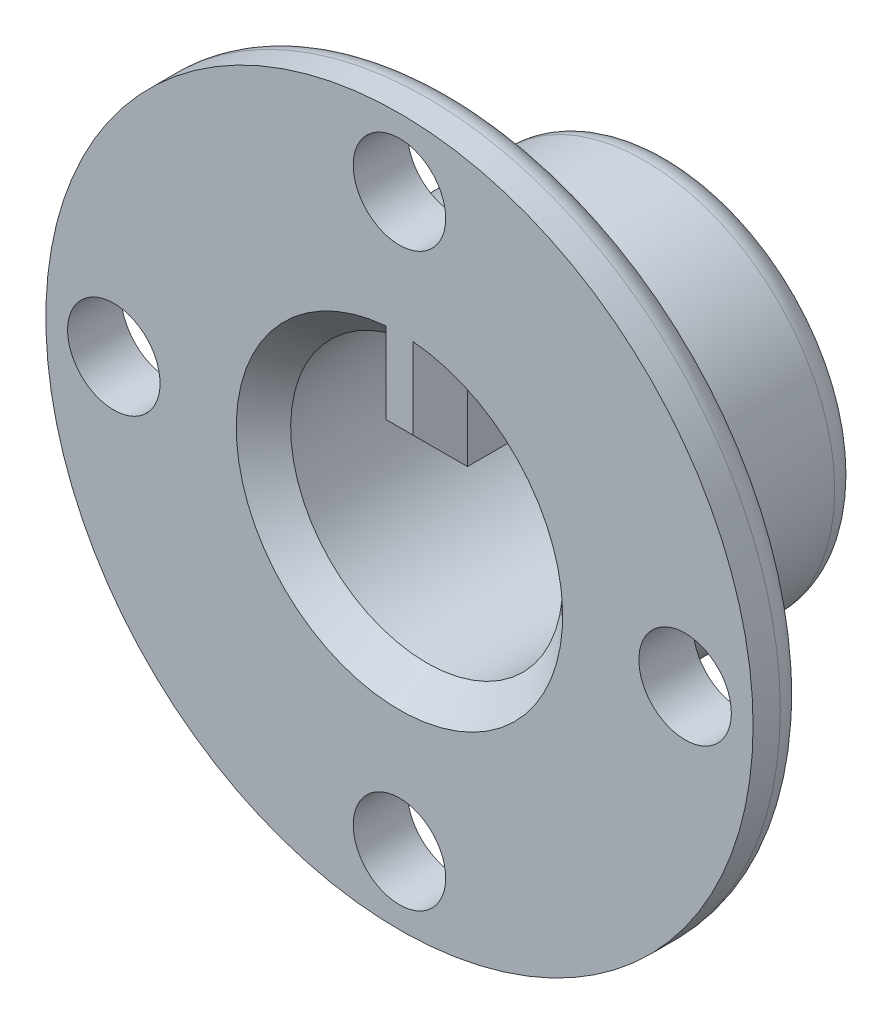
ISO-10303-21;
HEADER;
FILE_DESCRIPTION(('STEP AP214'),'2;1');
FILE_NAME('part.step','',(''),(''),'','','');
FILE_SCHEMA(('AUTOMOTIVE_DESIGN { 1 0 10303 214 1 1 1 1 }'));
ENDSEC;
DATA;
#1=APPLICATION_CONTEXT('core data for automotive mechanical design processes');
#2=APPLICATION_PROTOCOL_DEFINITION('international standard','automotive_design',2000,#1);
#3=PRODUCT_CONTEXT('',#1,'mechanical');
#4=PRODUCT('Part','Part','',(#3));
#5=PRODUCT_RELATED_PRODUCT_CATEGORY('part','',(#4));
#6=PRODUCT_DEFINITION_FORMATION('','',#4);
#7=PRODUCT_DEFINITION_CONTEXT('part definition',#1,'design');
#8=PRODUCT_DEFINITION('design','',#6,#7);
#9=PRODUCT_DEFINITION_SHAPE('','',#8);
#10=(LENGTH_UNIT() NAMED_UNIT(*) SI_UNIT(.MILLI.,.METRE.));
#11=(NAMED_UNIT(*) PLANE_ANGLE_UNIT() SI_UNIT($,.RADIAN.));
#12=(NAMED_UNIT(*) SI_UNIT($,.STERADIAN.) SOLID_ANGLE_UNIT());
#13=UNCERTAINTY_MEASURE_WITH_UNIT(LENGTH_MEASURE(1.E-05),#10,'distance_accuracy_value','');
#14=(GEOMETRIC_REPRESENTATION_CONTEXT(3) GLOBAL_UNCERTAINTY_ASSIGNED_CONTEXT((#13)) GLOBAL_UNIT_ASSIGNED_CONTEXT((#10,
#11,#12)) REPRESENTATION_CONTEXT('',''));
#15=CARTESIAN_POINT('',(0.,0.,0.));
#16=DIRECTION('',(0.,0.,1.));
#17=DIRECTION('',(1.,0.,0.));
#18=AXIS2_PLACEMENT_3D('',#15,#16,#17);
#19=CARTESIAN_POINT('',(0.,0.,-10.));
#20=DIRECTION('',(0.,0.,1.));
#21=DIRECTION('',(1.,0.,0.));
#22=AXIS2_PLACEMENT_3D('',#19,#20,#21);
#23=CYLINDRICAL_SURFACE('',#22,7.);
#24=CARTESIAN_POINT('',(0.,0.,-3.));
#25=DIRECTION('',(0.,0.,1.));
#26=DIRECTION('',(1.,0.,0.));
#27=AXIS2_PLACEMENT_3D('',#24,#25,#26);
#28=CIRCLE('',#27,7.);
#29=CARTESIAN_POINT('',(7.,0.,-3.));
#30=VERTEX_POINT('',#29);
#31=EDGE_CURVE('E574',#30,#30,#28,.F.);
#32=ORIENTED_EDGE('',*,*,#31,.T.);
#33=EDGE_LOOP('',(#32));
#34=FACE_BOUND('',#33,.T.);
#35=CARTESIAN_POINT('',(0.,0.,-9.));
#36=DIRECTION('',(0.,0.,1.));
#37=DIRECTION('',(1.,0.,0.));
#38=AXIS2_PLACEMENT_3D('',#35,#36,#37);
#39=CIRCLE('',#38,7.);
#40=CARTESIAN_POINT('',(7.,0.,-9.));
#41=VERTEX_POINT('',#40);
#42=EDGE_CURVE('E571',#41,#41,#39,.T.);
#43=ORIENTED_EDGE('',*,*,#42,.T.);
#44=EDGE_LOOP('',(#43));
#45=FACE_BOUND('',#44,.T.);
#46=ADVANCED_FACE('F36',(#34,#45),#23,.T.);
#47=CARTESIAN_POINT('',(0.,0.,-10.));
#48=DIRECTION('',(0.,0.,1.));
#49=DIRECTION('',(1.,0.,0.));
#50=AXIS2_PLACEMENT_3D('',#47,#48,#49);
#51=CYLINDRICAL_SURFACE('',#50,5.);
#52=DIRECTION('',(0.,0.,1.));
#53=VECTOR('',#52,1.);
#54=CARTESIAN_POINT('',(-1.5,4.76969600708473,-10.));
#55=LINE('',#54,#53);
#56=CARTESIAN_POINT('',(-1.5,4.76969600708473,-9.));
#57=VERTEX_POINT('',#56);
#58=CARTESIAN_POINT('',(-1.5,4.76969600708473,-1.));
#59=VERTEX_POINT('',#58);
#60=EDGE_CURVE('E136',#57,#59,#55,.T.);
#61=ORIENTED_EDGE('',*,*,#60,.T.);
#62=CARTESIAN_POINT('',(0.,0.,-1.));
#63=DIRECTION('',(0.,0.,1.));
#64=DIRECTION('',(1.,0.,0.));
#65=AXIS2_PLACEMENT_3D('',#62,#63,#64);
#66=CIRCLE('',#65,5.);
#67=CARTESIAN_POINT('',(1.5,4.76969600708473,-1.));
#68=VERTEX_POINT('',#67);
#69=EDGE_CURVE('E11',#59,#68,#66,.T.);
#70=ORIENTED_EDGE('',*,*,#69,.T.);
#71=DIRECTION('',(0.,0.,1.));
#72=VECTOR('',#71,1.);
#73=CARTESIAN_POINT('',(1.5,4.76969600708473,-10.));
#74=LINE('',#73,#72);
#75=CARTESIAN_POINT('',(1.5,4.76969600708473,-9.));
#76=VERTEX_POINT('',#75);
#77=EDGE_CURVE('E139',#76,#68,#74,.T.);
#78=ORIENTED_EDGE('',*,*,#77,.F.);
#79=CARTESIAN_POINT('',(0.,0.,-9.));
#80=DIRECTION('',(0.,0.,1.));
#81=DIRECTION('',(1.,0.,0.));
#82=AXIS2_PLACEMENT_3D('',#79,#80,#81);
#83=CIRCLE('',#82,5.);
#84=EDGE_CURVE('E134',#76,#57,#83,.F.);
#85=ORIENTED_EDGE('',*,*,#84,.T.);
#86=EDGE_LOOP('',(#61,#70,#78,#85));
#87=FACE_BOUND('',#86,.T.);
#88=ADVANCED_FACE('F135',(#87),#51,.F.);
#89=CARTESIAN_POINT('',(1.5,0.,-10.));
#90=DIRECTION('',(-1.,0.,0.));
#91=DIRECTION('',(0.,-1.,0.));
#92=AXIS2_PLACEMENT_3D('',#89,#90,#91);
#93=PLANE('',#92);
#94=ORIENTED_EDGE('',*,*,#77,.T.);
#95=DIRECTION('',(0.,-1.,0.));
#96=VECTOR('',#95,1.);
#97=CARTESIAN_POINT('',(1.5,2.,-1.));
#98=LINE('',#97,#96);
#99=CARTESIAN_POINT('',(1.5,2.,-1.));
#100=VERTEX_POINT('',#99);
#101=EDGE_CURVE('E502',#68,#100,#98,.T.);
#102=ORIENTED_EDGE('',*,*,#101,.T.);
#103=DIRECTION('',(0.,0.,1.));
#104=VECTOR('',#103,1.);
#105=CARTESIAN_POINT('',(1.5,2.,-10.));
#106=LINE('',#105,#104);
#107=CARTESIAN_POINT('',(1.5,2.,-9.));
#108=VERTEX_POINT('',#107);
#109=EDGE_CURVE('E170',#108,#100,#106,.T.);
#110=ORIENTED_EDGE('',*,*,#109,.F.);
#111=DIRECTION('',(0.,1.,0.));
#112=VECTOR('',#111,1.);
#113=CARTESIAN_POINT('',(1.5,0.,-9.));
#114=LINE('',#113,#112);
#115=EDGE_CURVE('E145',#108,#76,#114,.T.);
#116=ORIENTED_EDGE('',*,*,#115,.T.);
#117=EDGE_LOOP('',(#94,#102,#110,#116));
#118=FACE_BOUND('',#117,.T.);
#119=ADVANCED_FACE('F290',(#118),#93,.F.);
#120=CARTESIAN_POINT('',(0.,2.,-10.));
#121=DIRECTION('',(0.,-1.,0.));
#122=DIRECTION('',(0.,0.,-1.));
#123=AXIS2_PLACEMENT_3D('',#120,#121,#122);
#124=PLANE('',#123);
#125=ORIENTED_EDGE('',*,*,#109,.T.);
#126=DIRECTION('',(-1.,0.,0.));
#127=VECTOR('',#126,1.);
#128=CARTESIAN_POINT('',(0.,2.,-1.));
#129=LINE('',#128,#127);
#130=CARTESIAN_POINT('',(-1.5,2.,-1.));
#131=VERTEX_POINT('',#130);
#132=EDGE_CURVE('E66',#100,#131,#129,.T.);
#133=ORIENTED_EDGE('',*,*,#132,.T.);
#134=DIRECTION('',(0.,0.,1.));
#135=VECTOR('',#134,1.);
#136=CARTESIAN_POINT('',(-1.5,2.,-10.));
#137=LINE('',#136,#135);
#138=CARTESIAN_POINT('',(-1.5,2.,-9.));
#139=VERTEX_POINT('',#138);
#140=EDGE_CURVE('E151',#139,#131,#137,.T.);
#141=ORIENTED_EDGE('',*,*,#140,.F.);
#142=DIRECTION('',(1.,0.,0.));
#143=VECTOR('',#142,1.);
#144=CARTESIAN_POINT('',(1.5,2.,-9.));
#145=LINE('',#144,#143);
#146=EDGE_CURVE('E180',#139,#108,#145,.T.);
#147=ORIENTED_EDGE('',*,*,#146,.T.);
#148=EDGE_LOOP('',(#125,#133,#141,#147));
#149=FACE_BOUND('',#148,.T.);
#150=ADVANCED_FACE('F293',(#149),#124,.T.);
#151=CARTESIAN_POINT('',(-1.5,0.,-10.));
#152=DIRECTION('',(-1.,0.,0.));
#153=DIRECTION('',(0.,-1.,0.));
#154=AXIS2_PLACEMENT_3D('',#151,#152,#153);
#155=PLANE('',#154);
#156=ORIENTED_EDGE('',*,*,#140,.T.);
#157=DIRECTION('',(0.,1.,0.));
#158=VECTOR('',#157,1.);
#159=CARTESIAN_POINT('',(-1.5,0.,-1.));
#160=LINE('',#159,#158);
#161=EDGE_CURVE('E51',#131,#59,#160,.T.);
#162=ORIENTED_EDGE('',*,*,#161,.T.);
#163=ORIENTED_EDGE('',*,*,#60,.F.);
#164=DIRECTION('',(0.,-1.,0.));
#165=VECTOR('',#164,1.);
#166=CARTESIAN_POINT('',(-1.5,2.,-9.));
#167=LINE('',#166,#165);
#168=EDGE_CURVE('E150',#57,#139,#167,.T.);
#169=ORIENTED_EDGE('',*,*,#168,.T.);
#170=EDGE_LOOP('',(#156,#162,#163,#169));
#171=FACE_BOUND('',#170,.T.);
#172=ADVANCED_FACE('F148',(#171),#155,.T.);
#173=CARTESIAN_POINT('',(0.,0.,-10.));
#174=DIRECTION('',(0.,0.,1.));
#175=DIRECTION('',(1.,0.,0.));
#176=AXIS2_PLACEMENT_3D('',#173,#174,#175);
#177=PLANE('',#176);
#178=DIRECTION('',(0.,1.,0.));
#179=VECTOR('',#178,1.);
#180=CARTESIAN_POINT('',(-0.500000000000002,4.76969600708473,-10.));
#181=LINE('',#180,#179);
#182=CARTESIAN_POINT('',(-0.500000000000002,3.,-10.));
#183=VERTEX_POINT('',#182);
#184=CARTESIAN_POINT('',(-0.500000000000002,5.9791303715507,-10.));
#185=VERTEX_POINT('',#184);
#186=EDGE_CURVE('E178',#183,#185,#181,.T.);
#187=ORIENTED_EDGE('',*,*,#186,.T.);
#188=CARTESIAN_POINT('',(0.,0.,-10.));
#189=DIRECTION('',(0.,0.,1.));
#190=DIRECTION('',(1.,0.,0.));
#191=AXIS2_PLACEMENT_3D('',#188,#189,#190);
#192=CIRCLE('',#191,6.);
#193=CARTESIAN_POINT('',(0.500000000000001,5.9791303715507,-10.));
#194=VERTEX_POINT('',#193);
#195=EDGE_CURVE('E515',#185,#194,#192,.F.);
#196=ORIENTED_EDGE('',*,*,#195,.T.);
#197=DIRECTION('',(0.,-1.,0.));
#198=VECTOR('',#197,1.);
#199=CARTESIAN_POINT('',(0.500000000000002,0.,-10.));
#200=LINE('',#199,#198);
#201=CARTESIAN_POINT('',(0.500000000000002,3.,-10.));
#202=VERTEX_POINT('',#201);
#203=EDGE_CURVE('E168',#194,#202,#200,.T.);
#204=ORIENTED_EDGE('',*,*,#203,.T.);
#205=DIRECTION('',(-1.,0.,0.));
#206=VECTOR('',#205,1.);
#207=CARTESIAN_POINT('',(-1.5,3.,-10.));
#208=LINE('',#207,#206);
#209=EDGE_CURVE('E176',#202,#183,#208,.T.);
#210=ORIENTED_EDGE('',*,*,#209,.T.);
#211=EDGE_LOOP('',(#187,#196,#204,#210));
#212=FACE_BOUND('',#211,.T.);
#213=ADVANCED_FACE('F280',(#212),#177,.F.);
#214=CARTESIAN_POINT('',(0.,0.,0.));
#215=DIRECTION('',(0.,0.,1.));
#216=DIRECTION('',(1.,0.,0.));
#217=AXIS2_PLACEMENT_3D('',#214,#215,#216);
#218=PLANE('',#217);
#219=DIRECTION('',(1.,0.,0.));
#220=VECTOR('',#219,1.);
#221=CARTESIAN_POINT('',(0.,3.00000000000001,0.));
#222=LINE('',#221,#220);
#223=CARTESIAN_POINT('',(-0.499999999999995,3.00000000000001,0.));
#224=VERTEX_POINT('',#223);
#225=CARTESIAN_POINT('',(0.499999999999995,3.00000000000001,0.));
#226=VERTEX_POINT('',#225);
#227=EDGE_CURVE('E498',#224,#226,#222,.T.);
#228=ORIENTED_EDGE('',*,*,#227,.T.);
#229=DIRECTION('',(0.,1.,0.));
#230=VECTOR('',#229,1.);
#231=CARTESIAN_POINT('',(0.499999999999995,4.76969600708473,0.));
#232=LINE('',#231,#230);
#233=CARTESIAN_POINT('',(0.499999999999995,5.97913037155071,0.));
#234=VERTEX_POINT('',#233);
#235=EDGE_CURVE('E500',#226,#234,#232,.T.);
#236=ORIENTED_EDGE('',*,*,#235,.T.);
#237=CARTESIAN_POINT('',(0.,0.,0.));
#238=DIRECTION('',(0.,0.,1.));
#239=DIRECTION('',(1.,0.,0.));
#240=AXIS2_PLACEMENT_3D('',#237,#238,#239);
#241=CIRCLE('',#240,6.00000000000001);
#242=CARTESIAN_POINT('',(-0.499999999999995,5.97913037155071,0.));
#243=VERTEX_POINT('',#242);
#244=EDGE_CURVE('E494',#234,#243,#241,.F.);
#245=ORIENTED_EDGE('',*,*,#244,.T.);
#246=DIRECTION('',(0.,-1.,0.));
#247=VECTOR('',#246,1.);
#248=CARTESIAN_POINT('',(-0.499999999999995,0.,0.));
#249=LINE('',#248,#247);
#250=EDGE_CURVE('E497',#243,#224,#249,.T.);
#251=ORIENTED_EDGE('',*,*,#250,.T.);
#252=EDGE_LOOP('',(#228,#236,#245,#251));
#253=FACE_BOUND('',#252,.T.);
#254=CARTESIAN_POINT('',(0.,10.5,0.));
#255=DIRECTION('',(0.,0.,1.));
#256=DIRECTION('',(1.,0.,0.));
#257=AXIS2_PLACEMENT_3D('',#254,#255,#256);
#258=CIRCLE('',#257,1.69999999999999);
#259=CARTESIAN_POINT('',(1.69999999999999,10.5,0.));
#260=VERTEX_POINT('',#259);
#261=EDGE_CURVE('E206',#260,#260,#258,.T.);
#262=ORIENTED_EDGE('',*,*,#261,.F.);
#263=EDGE_LOOP('',(#262));
#264=FACE_BOUND('',#263,.T.);
#265=CARTESIAN_POINT('',(10.5000000000003,2.54785051264339E-13,0.));
#266=DIRECTION('',(0.,0.,1.));
#267=DIRECTION('',(1.,0.,0.));
#268=AXIS2_PLACEMENT_3D('',#265,#266,#267);
#269=CIRCLE('',#268,1.69999999999999);
#270=CARTESIAN_POINT('',(12.2000000000002,2.54785051264339E-13,0.));
#271=VERTEX_POINT('',#270);
#272=EDGE_CURVE('E533',#271,#271,#269,.T.);
#273=ORIENTED_EDGE('',*,*,#272,.F.);
#274=EDGE_LOOP('',(#273));
#275=FACE_BOUND('',#274,.T.);
#276=CARTESIAN_POINT('',(5.09570102528679E-13,-10.5,0.));
#277=DIRECTION('',(0.,0.,1.));
#278=DIRECTION('',(1.,0.,0.));
#279=AXIS2_PLACEMENT_3D('',#276,#277,#278);
#280=CIRCLE('',#279,1.69999999999999);
#281=CARTESIAN_POINT('',(1.7000000000005,-10.5,0.));
#282=VERTEX_POINT('',#281);
#283=EDGE_CURVE('E527',#282,#282,#280,.T.);
#284=ORIENTED_EDGE('',*,*,#283,.F.);
#285=EDGE_LOOP('',(#284));
#286=FACE_BOUND('',#285,.T.);
#287=CARTESIAN_POINT('',(-10.4999999999997,-2.53499172125235E-13,0.));
#288=DIRECTION('',(0.,0.,1.));
#289=DIRECTION('',(1.,0.,0.));
#290=AXIS2_PLACEMENT_3D('',#287,#288,#289);
#291=CIRCLE('',#290,1.69999999999999);
#292=CARTESIAN_POINT('',(-8.79999999999976,-2.53499172125235E-13,0.));
#293=VERTEX_POINT('',#292);
#294=EDGE_CURVE('E521',#293,#293,#291,.T.);
#295=ORIENTED_EDGE('',*,*,#294,.F.);
#296=EDGE_LOOP('',(#295));
#297=FACE_BOUND('',#296,.T.);
#298=CARTESIAN_POINT('',(0.,0.,0.));
#299=DIRECTION('',(0.,0.,1.));
#300=DIRECTION('',(1.,0.,0.));
#301=AXIS2_PLACEMENT_3D('',#298,#299,#300);
#302=CIRCLE('',#301,13.);
#303=CARTESIAN_POINT('',(13.,0.,0.));
#304=VERTEX_POINT('',#303);
#305=EDGE_CURVE('E152',#304,#304,#302,.T.);
#306=ORIENTED_EDGE('',*,*,#305,.T.);
#307=EDGE_LOOP('',(#306));
#308=FACE_BOUND('',#307,.T.);
#309=ADVANCED_FACE('F278',(#253,#264,#275,#286,#297,#308),#218,.T.);
#310=CARTESIAN_POINT('',(0.,0.,-2.));
#311=DIRECTION('',(0.,0.,1.));
#312=DIRECTION('',(1.,0.,0.));
#313=AXIS2_PLACEMENT_3D('',#310,#311,#312);
#314=CYLINDRICAL_SURFACE('',#313,13.);
#315=CARTESIAN_POINT('',(0.,0.,-1.));
#316=DIRECTION('',(0.,0.,1.));
#317=DIRECTION('',(1.,0.,0.));
#318=AXIS2_PLACEMENT_3D('',#315,#316,#317);
#319=CIRCLE('',#318,13.);
#320=CARTESIAN_POINT('',(13.,0.,-1.));
#321=VERTEX_POINT('',#320);
#322=EDGE_CURVE('E576',#321,#321,#319,.T.);
#323=ORIENTED_EDGE('',*,*,#322,.T.);
#324=EDGE_LOOP('',(#323));
#325=FACE_BOUND('',#324,.T.);
#326=ORIENTED_EDGE('',*,*,#305,.F.);
#327=EDGE_LOOP('',(#326));
#328=FACE_BOUND('',#327,.T.);
#329=ADVANCED_FACE('F274',(#325,#328),#314,.T.);
#330=CARTESIAN_POINT('',(0.,0.,-2.));
#331=DIRECTION('',(0.,0.,1.));
#332=DIRECTION('',(1.,0.,0.));
#333=AXIS2_PLACEMENT_3D('',#330,#331,#332);
#334=PLANE('',#333);
#335=CARTESIAN_POINT('',(0.,0.,-2.));
#336=DIRECTION('',(0.,0.,1.));
#337=DIRECTION('',(1.,0.,0.));
#338=AXIS2_PLACEMENT_3D('',#335,#336,#337);
#339=CIRCLE('',#338,8.);
#340=CARTESIAN_POINT('',(8.,0.,-2.));
#341=VERTEX_POINT('',#340);
#342=EDGE_CURVE('E566',#341,#341,#339,.T.);
#343=ORIENTED_EDGE('',*,*,#342,.T.);
#344=EDGE_LOOP('',(#343));
#345=FACE_BOUND('',#344,.T.);
#346=CARTESIAN_POINT('',(5.09570102528679E-13,-10.5,-2.));
#347=DIRECTION('',(0.,0.,1.));
#348=DIRECTION('',(1.,0.,0.));
#349=AXIS2_PLACEMENT_3D('',#346,#347,#348);
#350=CIRCLE('',#349,1.69999999999999);
#351=CARTESIAN_POINT('',(0.854692794659928,-11.9695238095238,-2.));
#352=VERTEX_POINT('',#351);
#353=CARTESIAN_POINT('',(-0.854692794658766,-11.9695238095239,-2.));
#354=VERTEX_POINT('',#353);
#355=EDGE_CURVE('E524',#352,#354,#350,.T.);
#356=ORIENTED_EDGE('',*,*,#355,.T.);
#357=CARTESIAN_POINT('',(0.,0.,-2.));
#358=DIRECTION('',(0.,0.,1.));
#359=DIRECTION('',(1.,0.,0.));
#360=AXIS2_PLACEMENT_3D('',#357,#358,#359);
#361=CIRCLE('',#360,12.);
#362=CARTESIAN_POINT('',(-11.9695238095238,-0.85469279465914,-2.));
#363=VERTEX_POINT('',#362);
#364=EDGE_CURVE('E560',#354,#363,#361,.F.);
#365=ORIENTED_EDGE('',*,*,#364,.T.);
#366=CARTESIAN_POINT('',(-10.4999999999997,-2.53499172125235E-13,-2.));
#367=DIRECTION('',(0.,0.,1.));
#368=DIRECTION('',(1.,0.,0.));
#369=AXIS2_PLACEMENT_3D('',#366,#367,#368);
#370=CIRCLE('',#369,1.69999999999999);
#371=CARTESIAN_POINT('',(-11.9695238095239,0.854692794658562,-2.));
#372=VERTEX_POINT('',#371);
#373=EDGE_CURVE('E173',#363,#372,#370,.T.);
#374=ORIENTED_EDGE('',*,*,#373,.T.);
#375=CARTESIAN_POINT('',(0.,0.,-2.));
#376=DIRECTION('',(0.,0.,1.));
#377=DIRECTION('',(1.,0.,0.));
#378=AXIS2_PLACEMENT_3D('',#375,#376,#377);
#379=CIRCLE('',#378,12.);
#380=CARTESIAN_POINT('',(-0.854692794659346,11.9695238095238,-2.));
#381=VERTEX_POINT('',#380);
#382=EDGE_CURVE('E557',#372,#381,#379,.F.);
#383=ORIENTED_EDGE('',*,*,#382,.T.);
#384=CARTESIAN_POINT('',(0.,10.5,-2.));
#385=DIRECTION('',(0.,0.,1.));
#386=DIRECTION('',(1.,0.,0.));
#387=AXIS2_PLACEMENT_3D('',#384,#385,#386);
#388=CIRCLE('',#387,1.69999999999999);
#389=CARTESIAN_POINT('',(0.854692794659347,11.9695238095238,-2.));
#390=VERTEX_POINT('',#389);
#391=EDGE_CURVE('E536',#381,#390,#388,.T.);
#392=ORIENTED_EDGE('',*,*,#391,.T.);
#393=CARTESIAN_POINT('',(0.,0.,-2.));
#394=DIRECTION('',(0.,0.,1.));
#395=DIRECTION('',(1.,0.,0.));
#396=AXIS2_PLACEMENT_3D('',#393,#394,#395);
#397=CIRCLE('',#396,12.);
#398=CARTESIAN_POINT('',(11.9695238095238,0.854692794660137,-2.));
#399=VERTEX_POINT('',#398);
#400=EDGE_CURVE('E564',#390,#399,#397,.F.);
#401=ORIENTED_EDGE('',*,*,#400,.T.);
#402=CARTESIAN_POINT('',(10.5000000000003,2.54785051264339E-13,-2.));
#403=DIRECTION('',(0.,0.,1.));
#404=DIRECTION('',(1.,0.,0.));
#405=AXIS2_PLACEMENT_3D('',#402,#403,#404);
#406=CIRCLE('',#405,1.69999999999999);
#407=CARTESIAN_POINT('',(11.9695238095238,-0.854692794659556,-2.));
#408=VERTEX_POINT('',#407);
#409=EDGE_CURVE('E530',#399,#408,#406,.T.);
#410=ORIENTED_EDGE('',*,*,#409,.T.);
#411=CARTESIAN_POINT('',(0.,0.,-2.));
#412=DIRECTION('',(0.,0.,1.));
#413=DIRECTION('',(1.,0.,0.));
#414=AXIS2_PLACEMENT_3D('',#411,#412,#413);
#415=CIRCLE('',#414,12.);
#416=EDGE_CURVE('E144',#408,#352,#415,.F.);
#417=ORIENTED_EDGE('',*,*,#416,.T.);
#418=EDGE_LOOP('',(#356,#365,#374,#383,#392,#401,#410,#417));
#419=FACE_BOUND('',#418,.T.);
#420=ADVANCED_FACE('F270',(#345,#419),#334,.F.);
#421=CARTESIAN_POINT('',(-10.4999999999997,-2.53499172125235E-13,0.));
#422=DIRECTION('',(0.,0.,1.));
#423=DIRECTION('',(1.,0.,0.));
#424=AXIS2_PLACEMENT_3D('',#421,#422,#423);
#425=CYLINDRICAL_SURFACE('',#424,1.69999999999999);
#426=ORIENTED_EDGE('',*,*,#294,.T.);
#427=EDGE_LOOP('',(#426));
#428=FACE_BOUND('',#427,.T.);
#429=ORIENTED_EDGE('',*,*,#373,.F.);
#430=CARTESIAN_POINT('',(-11.9695238095238,-0.85469279465914,-2.));
#431=CARTESIAN_POINT('',(-11.9907989521545,-0.818118476335102,-1.99999167514858));
#432=CARTESIAN_POINT('',(-12.0106996864025,-0.780754621558648,-1.9994802049691));
#433=CARTESIAN_POINT('',(-12.0476524940484,-0.704668530802149,-1.99780534300635));
#434=CARTESIAN_POINT('',(-12.0647052847368,-0.665946639842547,-1.99664211569875));
#435=CARTESIAN_POINT('',(-12.0958791685183,-0.587331427447288,-1.9940172436299));
#436=CARTESIAN_POINT('',(-12.1099991344167,-0.547437662315396,-1.99255548455819));
#437=CARTESIAN_POINT('',(-12.135226985244,-0.466715892591268,-1.98961919478434));
#438=CARTESIAN_POINT('',(-12.146334516253,-0.42588777883633,-1.98814466260252));
#439=CARTESIAN_POINT('',(-12.1773451283286,-0.292364612404048,-1.98376291937527));
#440=CARTESIAN_POINT('',(-12.1910768440933,-0.198128986292941,-1.98134629765861));
#441=CARTESIAN_POINT('',(-12.2026270400247,-0.00868965115883323,-1.97934392315493));
#442=CARTESIAN_POINT('',(-12.2004438006943,0.0865141613600884,-1.97975847625579));
#443=CARTESIAN_POINT('',(-12.1802946890029,0.274882177317589,-1.98314537919746));
#444=CARTESIAN_POINT('',(-12.1623761376599,0.368051638422774,-1.98611005945902));
#445=CARTESIAN_POINT('',(-12.1113279339275,0.550023365008609,-1.99259769710575));
#446=CARTESIAN_POINT('',(-12.0782216042406,0.638832096276497,-1.99611979309806));
#447=CARTESIAN_POINT('',(-12.0275547219862,0.746448062596245,-1.99875571250405));
#448=CARTESIAN_POINT('',(-12.0165983584882,0.768463230294706,-1.99920346087392));
#449=CARTESIAN_POINT('',(-11.9937561746306,0.811968859827391,-1.99982558668344));
#450=CARTESIAN_POINT('',(-11.9818717320704,0.833460039577419,-2.00000036156515));
#451=CARTESIAN_POINT('',(-11.9695238095239,0.854692794658562,-2.));
#452=B_SPLINE_CURVE_WITH_KNOTS('',3,(#430,#431,#432,#433,#434,#435,#436,#437,#438,#439,#440,
#441,#442,#443,#444,#445,#446,#447,#448,#449,#450,#451),.UNSPECIFIED.,.F.,.F.,(4,2,2,2,2,2,2,2,
2,2,4),(0.,0.126891225193106,0.253750442874268,0.380658327461467,0.507581115539993,
0.791880766971805,1.07621113540444,1.3596893502973,1.64273369919196,1.7165027060509,
1.79016420676154),.UNSPECIFIED.);
#453=EDGE_CURVE('E227',#363,#372,#452,.T.);
#454=ORIENTED_EDGE('',*,*,#453,.T.);
#455=EDGE_LOOP('',(#429,#454));
#456=FACE_BOUND('',#455,.T.);
#457=ADVANCED_FACE('F265',(#428,#456),#425,.F.);
#458=CARTESIAN_POINT('',(5.09570102528679E-13,-10.5,0.));
#459=DIRECTION('',(0.,0.,1.));
#460=DIRECTION('',(1.,0.,0.));
#461=AXIS2_PLACEMENT_3D('',#458,#459,#460);
#462=CYLINDRICAL_SURFACE('',#461,1.69999999999999);
#463=ORIENTED_EDGE('',*,*,#283,.T.);
#464=EDGE_LOOP('',(#463));
#465=FACE_BOUND('',#464,.T.);
#466=ORIENTED_EDGE('',*,*,#355,.F.);
#467=CARTESIAN_POINT('',(0.854692794659928,-11.9695238095238,-2.));
#468=CARTESIAN_POINT('',(0.818118476335897,-11.9907989521544,-1.99999167514858));
#469=CARTESIAN_POINT('',(0.780754621559451,-12.0106996864024,-1.99948020496909));
#470=CARTESIAN_POINT('',(0.704668530802964,-12.0476524940484,-1.99780534300634));
#471=CARTESIAN_POINT('',(0.665946639843369,-12.0647052847368,-1.99664211569874));
#472=CARTESIAN_POINT('',(0.587331427448122,-12.0958791685183,-1.99401724362989));
#473=CARTESIAN_POINT('',(0.547437662316234,-12.1099991344167,-1.99255548455818));
#474=CARTESIAN_POINT('',(0.466715892592115,-12.1352269852441,-1.98961919478432));
#475=CARTESIAN_POINT('',(0.425887778837181,-12.1463345162531,-1.9881446626025));
#476=CARTESIAN_POINT('',(0.292364612404914,-12.1773451283287,-1.98376291937523));
#477=CARTESIAN_POINT('',(0.198128986293814,-12.1910768440935,-1.98134629765858));
#478=CARTESIAN_POINT('',(0.00868965115971622,-12.202627040025,-1.97934392315488));
#479=CARTESIAN_POINT('',(-0.0865141613592034,-12.2004438006945,-1.97975847625574));
#480=CARTESIAN_POINT('',(-0.274882177316705,-12.1802946890032,-1.9831453791974));
#481=CARTESIAN_POINT('',(-0.368051638421895,-12.1623761376603,-1.98611005945895));
#482=CARTESIAN_POINT('',(-0.550023365007745,-12.111327933928,-1.9925976971057));
#483=CARTESIAN_POINT('',(-0.638832096275644,-12.0782216042411,-1.99611979309801));
#484=CARTESIAN_POINT('',(-0.746448062595587,-12.0275547219867,-1.99875571250403));
#485=CARTESIAN_POINT('',(-0.768463230294226,-12.0165983584886,-1.99920346087391));
#486=CARTESIAN_POINT('',(-0.811968859827258,-11.9937561746308,-1.99982558668344));
#487=CARTESIAN_POINT('',(-0.833460039577456,-11.9818717320705,-2.00000036156515));
#488=CARTESIAN_POINT('',(-0.854692794658766,-11.9695238095239,-2.));
#489=B_SPLINE_CURVE_WITH_KNOTS('',3,(#467,#468,#469,#470,#471,#472,#473,#474,#475,#476,#477,
#478,#479,#480,#481,#482,#483,#484,#485,#486,#487,#488),.UNSPECIFIED.,.F.,.F.,(4,2,2,2,2,2,2,2,
2,2,4),(0.,0.126891225193106,0.253750442874268,0.380658327461467,0.507581115539994,
0.791880766971799,1.07621113540442,1.35968935029727,1.64273369919193,1.71650270605146,
1.79016420676269),.UNSPECIFIED.);
#490=EDGE_CURVE('E250',#352,#354,#489,.T.);
#491=ORIENTED_EDGE('',*,*,#490,.T.);
#492=EDGE_LOOP('',(#466,#491));
#493=FACE_BOUND('',#492,.T.);
#494=ADVANCED_FACE('F260',(#465,#493),#462,.F.);
#495=CARTESIAN_POINT('',(10.5000000000003,2.54785051264339E-13,0.));
#496=DIRECTION('',(0.,0.,1.));
#497=DIRECTION('',(1.,0.,0.));
#498=AXIS2_PLACEMENT_3D('',#495,#496,#497);
#499=CYLINDRICAL_SURFACE('',#498,1.69999999999999);
#500=ORIENTED_EDGE('',*,*,#272,.T.);
#501=EDGE_LOOP('',(#500));
#502=FACE_BOUND('',#501,.T.);
#503=ORIENTED_EDGE('',*,*,#409,.F.);
#504=CARTESIAN_POINT('',(11.9695238095238,0.854692794660137,-2.));
#505=CARTESIAN_POINT('',(11.9907989521544,0.818118476336113,-1.99999167514858));
#506=CARTESIAN_POINT('',(12.0106996864024,0.780754621559673,-1.99948020496909));
#507=CARTESIAN_POINT('',(12.0476524940484,0.704668530803199,-1.99780534300634));
#508=CARTESIAN_POINT('',(12.0647052847369,0.665946639843609,-1.99664211569874));
#509=CARTESIAN_POINT('',(12.0958791685184,0.587331427448371,-1.99401724362989));
#510=CARTESIAN_POINT('',(12.1099991344168,0.547437662316488,-1.99255548455817));
#511=CARTESIAN_POINT('',(12.1352269852442,0.466715892592377,-1.9896191947843));
#512=CARTESIAN_POINT('',(12.1463345162532,0.425887778837446,-1.98814466260248));
#513=CARTESIAN_POINT('',(12.1773451283289,0.292364612405192,-1.9837629193752));
#514=CARTESIAN_POINT('',(12.1910768440937,0.198128986294099,-1.98134629765854));
#515=CARTESIAN_POINT('',(12.2026270400252,0.00868965116001067,-1.97934392315482));
#516=CARTESIAN_POINT('',(12.2004438006948,-0.0865141613589064,-1.97975847625568));
#517=CARTESIAN_POINT('',(12.1802946890036,-0.27488217731641,-1.98314537919734));
#518=CARTESIAN_POINT('',(12.1623761376607,-0.368051638421603,-1.98611005945889));
#519=CARTESIAN_POINT('',(12.1113279339284,-0.550023365007466,-1.99259769710565));
#520=CARTESIAN_POINT('',(12.0782216042416,-0.638832096275374,-1.99611979309797));
#521=CARTESIAN_POINT('',(12.0275547219871,-0.746448062595512,-1.99875571250401));
#522=CARTESIAN_POINT('',(12.0165983584889,-0.76846323029433,-1.9992034608739));
#523=CARTESIAN_POINT('',(11.993756174631,-0.811968859827712,-1.99982558668344));
#524=CARTESIAN_POINT('',(11.9818717320705,-0.833460039578081,-2.00000036156515));
#525=CARTESIAN_POINT('',(11.9695238095238,-0.854692794659555,-2.));
#526=B_SPLINE_CURVE_WITH_KNOTS('',3,(#504,#505,#506,#507,#508,#509,#510,#511,#512,#513,#514,
#515,#516,#517,#518,#519,#520,#521,#522,#523,#524,#525),.UNSPECIFIED.,.F.,.F.,(4,2,2,2,2,2,2,2,
2,2,4),(0.,0.126891225193105,0.253750442874268,0.380658327461468,0.507581115539995,
0.791880766971792,1.07621113540441,1.35968935029725,1.6427336991919,1.71650270605203,
1.79016420676384),.UNSPECIFIED.);
#527=EDGE_CURVE('E244',#399,#408,#526,.T.);
#528=ORIENTED_EDGE('',*,*,#527,.T.);
#529=EDGE_LOOP('',(#503,#528));
#530=FACE_BOUND('',#529,.T.);
#531=ADVANCED_FACE('F257',(#502,#530),#499,.F.);
#532=CARTESIAN_POINT('',(0.,10.5,0.));
#533=DIRECTION('',(0.,0.,1.));
#534=DIRECTION('',(1.,0.,0.));
#535=AXIS2_PLACEMENT_3D('',#532,#533,#534);
#536=CYLINDRICAL_SURFACE('',#535,1.69999999999999);
#537=ORIENTED_EDGE('',*,*,#261,.T.);
#538=EDGE_LOOP('',(#537));
#539=FACE_BOUND('',#538,.T.);
#540=ORIENTED_EDGE('',*,*,#391,.F.);
#541=CARTESIAN_POINT('',(-0.854692794659347,11.9695238095238,-2.));
#542=CARTESIAN_POINT('',(-0.818118476335315,11.9907989521545,-1.99999167514858));
#543=CARTESIAN_POINT('',(-0.780754621558868,12.0106996864025,-1.99948020496909));
#544=CARTESIAN_POINT('',(-0.70466853080238,12.0476524940484,-1.99780534300634));
#545=CARTESIAN_POINT('',(-0.665946639842784,12.0647052847368,-1.99664211569874));
#546=CARTESIAN_POINT('',(-0.587331427447536,12.0958791685183,-1.99401724362989));
#547=CARTESIAN_POINT('',(-0.547437662315647,12.1099991344168,-1.99255548455818));
#548=CARTESIAN_POINT('',(-0.466715892591527,12.1352269852441,-1.98961919478432));
#549=CARTESIAN_POINT('',(-0.425887778836592,12.1463345162531,-1.9881446626025));
#550=CARTESIAN_POINT('',(-0.292364612404323,12.1773451283288,-1.98376291937523));
#551=CARTESIAN_POINT('',(-0.198128986293223,12.1910768440935,-1.98134629765857));
#552=CARTESIAN_POINT('',(-0.00868965115912381,12.202627040025,-1.97934392315488));
#553=CARTESIAN_POINT('',(0.0865141613597955,12.2004438006945,-1.97975847625574));
#554=CARTESIAN_POINT('',(0.274882177317297,12.1802946890032,-1.9831453791974));
#555=CARTESIAN_POINT('',(0.368051638422486,12.1623761376603,-1.98611005945895));
#556=CARTESIAN_POINT('',(0.550023365008333,12.1113279339279,-1.9925976971057));
#557=CARTESIAN_POINT('',(0.63883209627623,12.0782216042411,-1.99611979309801));
#558=CARTESIAN_POINT('',(0.746448062596171,12.0275547219867,-1.99875571250403));
#559=CARTESIAN_POINT('',(0.76846323029481,12.0165983584885,-1.99920346087391));
#560=CARTESIAN_POINT('',(0.811968859827841,11.9937561746308,-1.99982558668344));
#561=CARTESIAN_POINT('',(0.833460039578039,11.9818717320704,-2.00000036156515));
#562=CARTESIAN_POINT('',(0.854692794659347,11.9695238095238,-2.));
#563=B_SPLINE_CURVE_WITH_KNOTS('',3,(#541,#542,#543,#544,#545,#546,#547,#548,#549,#550,#551,
#552,#553,#554,#555,#556,#557,#558,#559,#560,#561,#562),.UNSPECIFIED.,.F.,.F.,(4,2,2,2,2,2,2,2,
2,2,4),(0.,0.126891225193105,0.253750442874266,0.380658327461466,0.507581115539994,
0.791880766971798,1.07621113540442,1.35968935029727,1.64273369919193,1.71650270605146,
1.79016420676269),.UNSPECIFIED.);
#564=EDGE_CURVE('E237',#381,#390,#563,.T.);
#565=ORIENTED_EDGE('',*,*,#564,.T.);
#566=EDGE_LOOP('',(#540,#565));
#567=FACE_BOUND('',#566,.T.);
#568=ADVANCED_FACE('F211',(#539,#567),#536,.F.);
#569=CARTESIAN_POINT('',(0.500000000000002,0.,-10.));
#570=DIRECTION('',(-0.707106781186548,0.,0.707106781186547));
#571=DIRECTION('',(0.,-1.,0.));
#572=AXIS2_PLACEMENT_3D('',#569,#570,#571);
#573=PLANE('',#572);
#574=DIRECTION('',(0.577350269189625,-0.577350269189625,0.577350269189627));
#575=VECTOR('',#574,1.);
#576=CARTESIAN_POINT('',(1.5,2.,-9.));
#577=LINE('',#576,#575);
#578=EDGE_CURVE('E161',#202,#108,#577,.T.);
#579=ORIENTED_EDGE('',*,*,#578,.F.);
#580=ORIENTED_EDGE('',*,*,#203,.F.);
#581=CARTESIAN_POINT('',(1.5,4.76969600708473,-9.));
#582=CARTESIAN_POINT('',(1.42095355050623,4.8774027763305,-9.07904644949377));
#583=CARTESIAN_POINT('',(1.34063700117364,4.98322291382426,-9.15936299882636));
#584=CARTESIAN_POINT('',(1.17781682387917,5.19126481273364,-9.32218317612083));
#585=CARTESIAN_POINT('',(1.09531493013495,5.29348928594511,-9.40468506986505));
#586=CARTESIAN_POINT('',(0.928369259776084,5.49466213419555,-9.57163074022392));
#587=CARTESIAN_POINT('',(0.843925831839633,5.5936110898134,-9.65607416816037));
#588=CARTESIAN_POINT('',(0.673240930942593,5.78855320924758,-9.82675906905741));
#589=CARTESIAN_POINT('',(0.586998121794159,5.8845440351581,-9.91300187820584));
#590=CARTESIAN_POINT('',(0.500000000000001,5.9791303715507,-10.));
#591=B_SPLINE_CURVE_WITH_KNOTS('',3,(#581,#582,#583,#584,#585,#586,#587,#588,#589,#590),
.UNSPECIFIED.,.F.,.F.,(4,2,2,2,4),(0.,0.46565623094549,0.930953393261512,1.39616763612918,
1.86174058477512),.UNSPECIFIED.);
#592=EDGE_CURVE('E200',#76,#194,#591,.T.);
#593=ORIENTED_EDGE('',*,*,#592,.F.);
#594=ORIENTED_EDGE('',*,*,#115,.F.);
#595=EDGE_LOOP('',(#579,#580,#593,#594));
#596=FACE_BOUND('',#595,.T.);
#597=ADVANCED_FACE('F197',(#596),#573,.F.);
#598=CARTESIAN_POINT('',(0.,0.,-10.));
#599=DIRECTION('',(0.,0.,-1.));
#600=DIRECTION('',(-1.,0.,0.));
#601=AXIS2_PLACEMENT_3D('',#598,#599,#600);
#602=CONICAL_SURFACE('',#601,6.,0.785398163397447);
#603=ORIENTED_EDGE('',*,*,#592,.T.);
#604=CARTESIAN_POINT('',(0.,0.,-10.));
#605=DIRECTION('',(0.,0.,1.));
#606=DIRECTION('',(1.,0.,0.));
#607=AXIS2_PLACEMENT_3D('',#604,#605,#606);
#608=CIRCLE('',#607,6.);
#609=EDGE_CURVE('E157',#185,#194,#608,.T.);
#610=ORIENTED_EDGE('',*,*,#609,.F.);
#611=CARTESIAN_POINT('',(-0.500000000000002,5.9791303715507,-10.));
#612=CARTESIAN_POINT('',(-0.586998121794159,5.8845440351581,-9.91300187820584));
#613=CARTESIAN_POINT('',(-0.673240930942593,5.78855320924758,-9.82675906905741));
#614=CARTESIAN_POINT('',(-0.843925831839633,5.5936110898134,-9.65607416816037));
#615=CARTESIAN_POINT('',(-0.928369259776084,5.49466213419555,-9.57163074022392));
#616=CARTESIAN_POINT('',(-1.09531493013495,5.29348928594511,-9.40468506986505));
#617=CARTESIAN_POINT('',(-1.17781682387917,5.19126481273364,-9.32218317612083));
#618=CARTESIAN_POINT('',(-1.34063700117364,4.98322291382426,-9.15936299882636));
#619=CARTESIAN_POINT('',(-1.42095355050623,4.8774027763305,-9.07904644949377));
#620=CARTESIAN_POINT('',(-1.5,4.76969600708473,-9.));
#621=B_SPLINE_CURVE_WITH_KNOTS('',3,(#611,#612,#613,#614,#615,#616,#617,#618,#619,#620),
.UNSPECIFIED.,.F.,.F.,(4,2,2,2,4),(0.,0.465572948645943,0.930787191513609,1.39608435382963,
1.86174058477512),.UNSPECIFIED.);
#622=EDGE_CURVE('E155',#57,#185,#621,.F.);
#623=ORIENTED_EDGE('',*,*,#622,.F.);
#624=ORIENTED_EDGE('',*,*,#84,.F.);
#625=EDGE_LOOP('',(#603,#610,#623,#624));
#626=FACE_BOUND('',#625,.T.);
#627=ADVANCED_FACE('F156',(#626),#602,.F.);
#628=CARTESIAN_POINT('',(0.,2.,-9.));
#629=DIRECTION('',(0.,-0.707106781186548,-0.707106781186547));
#630=DIRECTION('',(-1.,0.,0.));
#631=AXIS2_PLACEMENT_3D('',#628,#629,#630);
#632=PLANE('',#631);
#633=ORIENTED_EDGE('',*,*,#578,.T.);
#634=ORIENTED_EDGE('',*,*,#146,.F.);
#635=DIRECTION('',(0.577350269189625,0.577350269189625,-0.577350269189627));
#636=VECTOR('',#635,1.);
#637=CARTESIAN_POINT('',(-1.,2.5,-9.5));
#638=LINE('',#637,#636);
#639=EDGE_CURVE('E162',#183,#139,#638,.F.);
#640=ORIENTED_EDGE('',*,*,#639,.F.);
#641=ORIENTED_EDGE('',*,*,#209,.F.);
#642=EDGE_LOOP('',(#633,#634,#640,#641));
#643=FACE_BOUND('',#642,.T.);
#644=ADVANCED_FACE('F196',(#643),#632,.T.);
#645=CARTESIAN_POINT('',(-1.5,0.,-9.));
#646=DIRECTION('',(-0.707106781186548,0.,-0.707106781186547));
#647=DIRECTION('',(0.,1.,0.));
#648=AXIS2_PLACEMENT_3D('',#645,#646,#647);
#649=PLANE('',#648);
#650=ORIENTED_EDGE('',*,*,#622,.T.);
#651=ORIENTED_EDGE('',*,*,#186,.F.);
#652=ORIENTED_EDGE('',*,*,#639,.T.);
#653=ORIENTED_EDGE('',*,*,#168,.F.);
#654=EDGE_LOOP('',(#650,#651,#652,#653));
#655=FACE_BOUND('',#654,.T.);
#656=ADVANCED_FACE('F164',(#655),#649,.T.);
#657=CARTESIAN_POINT('',(0.,0.,-3.));
#658=DIRECTION('',(0.,0.,1.));
#659=DIRECTION('',(1.,0.,0.));
#660=AXIS2_PLACEMENT_3D('',#657,#658,#659);
#661=TOROIDAL_SURFACE('',#660,8.,1.);
#662=ORIENTED_EDGE('',*,*,#31,.F.);
#663=EDGE_LOOP('',(#662));
#664=FACE_BOUND('',#663,.T.);
#665=ORIENTED_EDGE('',*,*,#342,.F.);
#666=EDGE_LOOP('',(#665));
#667=FACE_BOUND('',#666,.T.);
#668=ADVANCED_FACE('F213',(#664,#667),#661,.F.);
#669=CARTESIAN_POINT('',(0.,0.,-1.));
#670=DIRECTION('',(0.,0.,1.));
#671=DIRECTION('',(1.,0.,0.));
#672=AXIS2_PLACEMENT_3D('',#669,#670,#671);
#673=TOROIDAL_SURFACE('',#672,12.,1.);
#674=ORIENTED_EDGE('',*,*,#453,.F.);
#675=ORIENTED_EDGE('',*,*,#364,.F.);
#676=ORIENTED_EDGE('',*,*,#490,.F.);
#677=ORIENTED_EDGE('',*,*,#416,.F.);
#678=ORIENTED_EDGE('',*,*,#527,.F.);
#679=ORIENTED_EDGE('',*,*,#400,.F.);
#680=ORIENTED_EDGE('',*,*,#564,.F.);
#681=ORIENTED_EDGE('',*,*,#382,.F.);
#682=EDGE_LOOP('',(#674,#675,#676,#677,#678,#679,#680,#681));
#683=FACE_BOUND('',#682,.T.);
#684=ORIENTED_EDGE('',*,*,#322,.F.);
#685=EDGE_LOOP('',(#684));
#686=FACE_BOUND('',#685,.T.);
#687=ADVANCED_FACE('F216',(#683,#686),#673,.T.);
#688=CARTESIAN_POINT('',(0.,0.,-9.));
#689=DIRECTION('',(0.,0.,1.));
#690=DIRECTION('',(1.,0.,0.));
#691=AXIS2_PLACEMENT_3D('',#688,#689,#690);
#692=TOROIDAL_SURFACE('',#691,6.,1.);
#693=ORIENTED_EDGE('',*,*,#609,.T.);
#694=ORIENTED_EDGE('',*,*,#195,.F.);
#695=EDGE_LOOP('',(#693,#694));
#696=FACE_BOUND('',#695,.T.);
#697=ORIENTED_EDGE('',*,*,#42,.F.);
#698=EDGE_LOOP('',(#697));
#699=FACE_BOUND('',#698,.T.);
#700=ADVANCED_FACE('F221',(#696,#699),#692,.T.);
#701=CARTESIAN_POINT('',(-0.499999999999995,0.,0.));
#702=DIRECTION('',(0.707106781186547,0.,-0.707106781186548));
#703=DIRECTION('',(0.,-1.,0.));
#704=AXIS2_PLACEMENT_3D('',#701,#702,#703);
#705=PLANE('',#704);
#706=DIRECTION('',(0.577350269189626,0.577350269189626,0.577350269189625));
#707=VECTOR('',#706,1.);
#708=CARTESIAN_POINT('',(-1.5,2.,-1.));
#709=LINE('',#708,#707);
#710=EDGE_CURVE('E485',#224,#131,#709,.F.);
#711=ORIENTED_EDGE('',*,*,#710,.F.);
#712=ORIENTED_EDGE('',*,*,#250,.F.);
#713=CARTESIAN_POINT('',(-1.5,4.76969600708473,-1.));
#714=CARTESIAN_POINT('',(-1.42095355050623,4.8774027763305,-0.920953550506231));
#715=CARTESIAN_POINT('',(-1.34063700117364,4.98322291382426,-0.840637001173645));
#716=CARTESIAN_POINT('',(-1.17781682387916,5.19126481273364,-0.677816823879167));
#717=CARTESIAN_POINT('',(-1.09531493013495,5.29348928594511,-0.59531493013495));
#718=CARTESIAN_POINT('',(-0.92836925977608,5.49466213419556,-0.428369259776084));
#719=CARTESIAN_POINT('',(-0.843925831839629,5.5936110898134,-0.343925831839633));
#720=CARTESIAN_POINT('',(-0.673240930942588,5.78855320924759,-0.173240930942593));
#721=CARTESIAN_POINT('',(-0.586998121794153,5.88454403515811,-0.0869981217941577));
#722=CARTESIAN_POINT('',(-0.499999999999994,5.97913037155071,0.));
#723=B_SPLINE_CURVE_WITH_KNOTS('',3,(#713,#714,#715,#716,#717,#718,#719,#720,#721,#722),
.UNSPECIFIED.,.F.,.F.,(4,2,2,2,4),(0.,0.465656230945493,0.930953393261517,1.39616763612918,
1.86174058477513),.UNSPECIFIED.);
#724=EDGE_CURVE('E41',#59,#243,#723,.T.);
#725=ORIENTED_EDGE('',*,*,#724,.F.);
#726=ORIENTED_EDGE('',*,*,#161,.F.);
#727=EDGE_LOOP('',(#711,#712,#725,#726));
#728=FACE_BOUND('',#727,.T.);
#729=ADVANCED_FACE('F38',(#728),#705,.F.);
#730=CARTESIAN_POINT('',(0.,0.,-1.));
#731=DIRECTION('',(0.,0.,1.));
#732=DIRECTION('',(1.,0.,0.));
#733=AXIS2_PLACEMENT_3D('',#730,#731,#732);
#734=CONICAL_SURFACE('',#733,5.,0.78539816339745);
#735=ORIENTED_EDGE('',*,*,#724,.T.);
#736=ORIENTED_EDGE('',*,*,#244,.F.);
#737=CARTESIAN_POINT('',(0.499999999999995,5.97913037155071,0.));
#738=CARTESIAN_POINT('',(0.586998121794153,5.88454403515811,-0.086998121794158));
#739=CARTESIAN_POINT('',(0.673240930942588,5.78855320924759,-0.173240930942593));
#740=CARTESIAN_POINT('',(0.843925831839629,5.5936110898134,-0.343925831839633));
#741=CARTESIAN_POINT('',(0.92836925977608,5.49466213419556,-0.428369259776084));
#742=CARTESIAN_POINT('',(1.09531493013495,5.29348928594511,-0.59531493013495));
#743=CARTESIAN_POINT('',(1.17781682387916,5.19126481273365,-0.677816823879167));
#744=CARTESIAN_POINT('',(1.34063700117364,4.98322291382426,-0.840637001173645));
#745=CARTESIAN_POINT('',(1.42095355050623,4.8774027763305,-0.920953550506231));
#746=CARTESIAN_POINT('',(1.5,4.76969600708473,-1.));
#747=B_SPLINE_CURVE_WITH_KNOTS('',3,(#737,#738,#739,#740,#741,#742,#743,#744,#745,#746),
.UNSPECIFIED.,.F.,.F.,(4,2,2,2,4),(0.,0.465572948645945,0.930787191513612,1.39608435382964,
1.86174058477513),.UNSPECIFIED.);
#748=EDGE_CURVE('E479',#68,#234,#747,.F.);
#749=ORIENTED_EDGE('',*,*,#748,.F.);
#750=ORIENTED_EDGE('',*,*,#69,.F.);
#751=EDGE_LOOP('',(#735,#736,#749,#750));
#752=FACE_BOUND('',#751,.T.);
#753=ADVANCED_FACE('F388',(#752),#734,.F.);
#754=CARTESIAN_POINT('',(0.,3.00000000000001,0.));
#755=DIRECTION('',(0.,0.707106781186547,-0.707106781186548));
#756=DIRECTION('',(1.,0.,0.));
#757=AXIS2_PLACEMENT_3D('',#754,#755,#756);
#758=PLANE('',#757);
#759=ORIENTED_EDGE('',*,*,#710,.T.);
#760=ORIENTED_EDGE('',*,*,#132,.F.);
#761=DIRECTION('',(0.577350269189626,-0.577350269189626,-0.577350269189625));
#762=VECTOR('',#761,1.);
#763=CARTESIAN_POINT('',(0.33333333333333,3.16666666666667,0.166666666666665));
#764=LINE('',#763,#762);
#765=EDGE_CURVE('E486',#226,#100,#764,.T.);
#766=ORIENTED_EDGE('',*,*,#765,.F.);
#767=ORIENTED_EDGE('',*,*,#227,.F.);
#768=EDGE_LOOP('',(#759,#760,#766,#767));
#769=FACE_BOUND('',#768,.T.);
#770=ADVANCED_FACE('F395',(#769),#758,.F.);
#771=CARTESIAN_POINT('',(1.5,0.,-1.));
#772=DIRECTION('',(0.707106781186547,0.,0.707106781186548));
#773=DIRECTION('',(0.,1.,0.));
#774=AXIS2_PLACEMENT_3D('',#771,#772,#773);
#775=PLANE('',#774);
#776=ORIENTED_EDGE('',*,*,#748,.T.);
#777=ORIENTED_EDGE('',*,*,#235,.F.);
#778=ORIENTED_EDGE('',*,*,#765,.T.);
#779=ORIENTED_EDGE('',*,*,#101,.F.);
#780=EDGE_LOOP('',(#776,#777,#778,#779));
#781=FACE_BOUND('',#780,.T.);
#782=ADVANCED_FACE('F402',(#781),#775,.T.);
#783=CLOSED_SHELL('',(#46,#88,#119,#150,#172,#213,#309,#329,#420,#457,#494,#531,#568,#597,#627,
#644,#656,#668,#687,#700,#729,#753,#770,#782));
#784=MANIFOLD_SOLID_BREP('B2',#783);
#785=ADVANCED_BREP_SHAPE_REPRESENTATION('',(#18,#784),#14);
#786=SHAPE_DEFINITION_REPRESENTATION(#9,#785);
ENDSEC;
END-ISO-10303-21;
